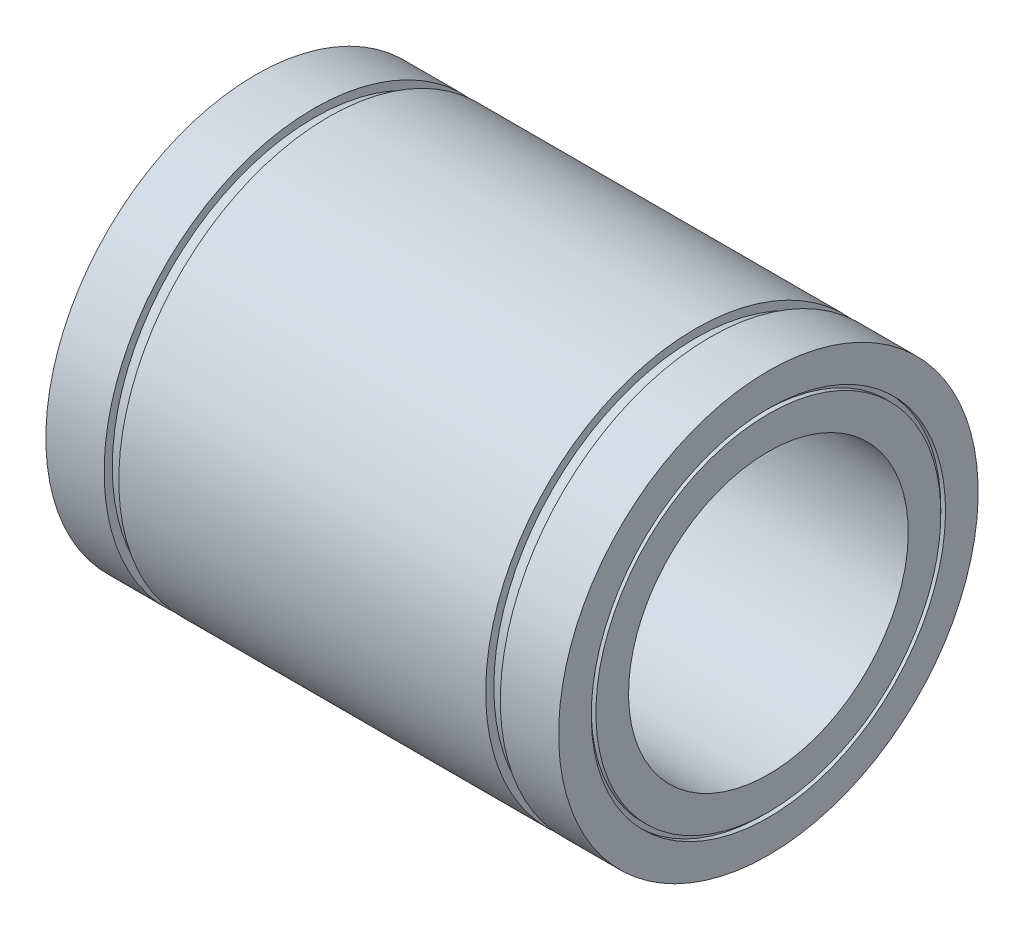
ISO-10303-21;
HEADER;
FILE_DESCRIPTION(('STEP AP214'),'2;1');
FILE_NAME('part.step','',(''),(''),'','','');
FILE_SCHEMA(('AUTOMOTIVE_DESIGN { 1 0 10303 214 1 1 1 1 }'));
ENDSEC;
DATA;
#1=APPLICATION_CONTEXT('core data for automotive mechanical design processes');
#2=APPLICATION_PROTOCOL_DEFINITION('international standard','automotive_design',2000,#1);
#3=PRODUCT_CONTEXT('',#1,'mechanical');
#4=PRODUCT('Part','Part','',(#3));
#5=PRODUCT_RELATED_PRODUCT_CATEGORY('part','',(#4));
#6=PRODUCT_DEFINITION_FORMATION('','',#4);
#7=PRODUCT_DEFINITION_CONTEXT('part definition',#1,'design');
#8=PRODUCT_DEFINITION('design','',#6,#7);
#9=PRODUCT_DEFINITION_SHAPE('','',#8);
#10=(LENGTH_UNIT() NAMED_UNIT(*) SI_UNIT(.MILLI.,.METRE.));
#11=(NAMED_UNIT(*) PLANE_ANGLE_UNIT() SI_UNIT($,.RADIAN.));
#12=(NAMED_UNIT(*) SI_UNIT($,.STERADIAN.) SOLID_ANGLE_UNIT());
#13=UNCERTAINTY_MEASURE_WITH_UNIT(LENGTH_MEASURE(1.E-05),#10,'distance_accuracy_value','');
#14=(GEOMETRIC_REPRESENTATION_CONTEXT(3) GLOBAL_UNCERTAINTY_ASSIGNED_CONTEXT((#13)) GLOBAL_UNIT_ASSIGNED_CONTEXT((#10,
#11,#12)) REPRESENTATION_CONTEXT('',''));
#15=CARTESIAN_POINT('',(0.,0.,0.));
#16=DIRECTION('',(0.,0.,1.));
#17=DIRECTION('',(1.,0.,0.));
#18=AXIS2_PLACEMENT_3D('',#15,#16,#17);
#19=CARTESIAN_POINT('',(-55.,38.,0.));
#20=DIRECTION('',(-1.,0.,0.));
#21=DIRECTION('',(0.,-1.,0.));
#22=AXIS2_PLACEMENT_3D('',#19,#20,#21);
#23=PLANE('',#22);
#24=CARTESIAN_POINT('',(-55.,0.,0.));
#25=DIRECTION('',(1.,0.,0.));
#26=DIRECTION('',(0.,1.,0.));
#27=AXIS2_PLACEMENT_3D('',#24,#25,#26);
#28=CIRCLE('',#27,38.);
#29=CARTESIAN_POINT('',(-55.,38.,0.));
#30=VERTEX_POINT('',#29);
#31=EDGE_CURVE('E121',#30,#30,#28,.T.);
#32=ORIENTED_EDGE('',*,*,#31,.T.);
#33=EDGE_LOOP('',(#32));
#34=FACE_BOUND('',#33,.T.);
#35=CARTESIAN_POINT('',(-55.,0.,0.));
#36=DIRECTION('',(1.,0.,0.));
#37=DIRECTION('',(0.,1.,0.));
#38=AXIS2_PLACEMENT_3D('',#35,#36,#37);
#39=CIRCLE('',#38,45.);
#40=CARTESIAN_POINT('',(-55.,45.,0.));
#41=VERTEX_POINT('',#40);
#42=EDGE_CURVE('E10',#41,#41,#39,.T.);
#43=ORIENTED_EDGE('',*,*,#42,.F.);
#44=EDGE_LOOP('',(#43));
#45=FACE_BOUND('',#44,.T.);
#46=ADVANCED_FACE('F38',(#34,#45),#23,.T.);
#47=CARTESIAN_POINT('',(0.,0.,0.));
#48=DIRECTION('',(1.,0.,0.));
#49=DIRECTION('',(0.,1.,0.));
#50=AXIS2_PLACEMENT_3D('',#47,#48,#49);
#51=CYLINDRICAL_SURFACE('',#50,45.);
#52=ORIENTED_EDGE('',*,*,#42,.T.);
#53=EDGE_LOOP('',(#52));
#54=FACE_BOUND('',#53,.T.);
#55=CARTESIAN_POINT('',(-42.5,0.,0.));
#56=DIRECTION('',(1.,0.,0.));
#57=DIRECTION('',(0.,1.,0.));
#58=AXIS2_PLACEMENT_3D('',#55,#56,#57);
#59=CIRCLE('',#58,45.);
#60=CARTESIAN_POINT('',(-42.5,45.,0.));
#61=VERTEX_POINT('',#60);
#62=EDGE_CURVE('E45',#61,#61,#59,.T.);
#63=ORIENTED_EDGE('',*,*,#62,.F.);
#64=EDGE_LOOP('',(#63));
#65=FACE_BOUND('',#64,.T.);
#66=ADVANCED_FACE('F140',(#54,#65),#51,.T.);
#67=CARTESIAN_POINT('',(-42.5,45.,0.));
#68=DIRECTION('',(1.,0.,0.));
#69=DIRECTION('',(0.,1.,0.));
#70=AXIS2_PLACEMENT_3D('',#67,#68,#69);
#71=PLANE('',#70);
#72=ORIENTED_EDGE('',*,*,#62,.T.);
#73=EDGE_LOOP('',(#72));
#74=FACE_BOUND('',#73,.T.);
#75=CARTESIAN_POINT('',(-42.5,0.,0.));
#76=DIRECTION('',(1.,0.,0.));
#77=DIRECTION('',(0.,1.,0.));
#78=AXIS2_PLACEMENT_3D('',#75,#76,#77);
#79=CIRCLE('',#78,43.25);
#80=CARTESIAN_POINT('',(-42.5,43.25,0.));
#81=VERTEX_POINT('',#80);
#82=EDGE_CURVE('E52',#81,#81,#79,.T.);
#83=ORIENTED_EDGE('',*,*,#82,.F.);
#84=EDGE_LOOP('',(#83));
#85=FACE_BOUND('',#84,.T.);
#86=ADVANCED_FACE('F144',(#74,#85),#71,.T.);
#87=CARTESIAN_POINT('',(0.,0.,0.));
#88=DIRECTION('',(1.,0.,0.));
#89=DIRECTION('',(0.,1.,0.));
#90=AXIS2_PLACEMENT_3D('',#87,#88,#89);
#91=CYLINDRICAL_SURFACE('',#90,43.25);
#92=ORIENTED_EDGE('',*,*,#82,.T.);
#93=EDGE_LOOP('',(#92));
#94=FACE_BOUND('',#93,.T.);
#95=CARTESIAN_POINT('',(-39.35,0.,0.));
#96=DIRECTION('',(1.,0.,0.));
#97=DIRECTION('',(0.,1.,0.));
#98=AXIS2_PLACEMENT_3D('',#95,#96,#97);
#99=CIRCLE('',#98,43.25);
#100=CARTESIAN_POINT('',(-39.35,43.25,0.));
#101=VERTEX_POINT('',#100);
#102=EDGE_CURVE('E59',#101,#101,#99,.T.);
#103=ORIENTED_EDGE('',*,*,#102,.F.);
#104=EDGE_LOOP('',(#103));
#105=FACE_BOUND('',#104,.T.);
#106=ADVANCED_FACE('F148',(#94,#105),#91,.T.);
#107=CARTESIAN_POINT('',(-39.35,43.25,0.));
#108=DIRECTION('',(-1.,0.,0.));
#109=DIRECTION('',(0.,-1.,0.));
#110=AXIS2_PLACEMENT_3D('',#107,#108,#109);
#111=PLANE('',#110);
#112=ORIENTED_EDGE('',*,*,#102,.T.);
#113=EDGE_LOOP('',(#112));
#114=FACE_BOUND('',#113,.T.);
#115=CARTESIAN_POINT('',(-39.35,0.,0.));
#116=DIRECTION('',(1.,0.,0.));
#117=DIRECTION('',(0.,1.,0.));
#118=AXIS2_PLACEMENT_3D('',#115,#116,#117);
#119=CIRCLE('',#118,45.);
#120=CARTESIAN_POINT('',(-39.35,45.,0.));
#121=VERTEX_POINT('',#120);
#122=EDGE_CURVE('E65',#121,#121,#119,.T.);
#123=ORIENTED_EDGE('',*,*,#122,.F.);
#124=EDGE_LOOP('',(#123));
#125=FACE_BOUND('',#124,.T.);
#126=ADVANCED_FACE('F154',(#114,#125),#111,.T.);
#127=CARTESIAN_POINT('',(0.,0.,0.));
#128=DIRECTION('',(1.,0.,0.));
#129=DIRECTION('',(0.,1.,0.));
#130=AXIS2_PLACEMENT_3D('',#127,#128,#129);
#131=CYLINDRICAL_SURFACE('',#130,45.);
#132=ORIENTED_EDGE('',*,*,#122,.T.);
#133=EDGE_LOOP('',(#132));
#134=FACE_BOUND('',#133,.T.);
#135=CARTESIAN_POINT('',(39.35,0.,0.));
#136=DIRECTION('',(1.,0.,0.));
#137=DIRECTION('',(0.,1.,0.));
#138=AXIS2_PLACEMENT_3D('',#135,#136,#137);
#139=CIRCLE('',#138,45.);
#140=CARTESIAN_POINT('',(39.35,45.,0.));
#141=VERTEX_POINT('',#140);
#142=EDGE_CURVE('E69',#141,#141,#139,.T.);
#143=ORIENTED_EDGE('',*,*,#142,.F.);
#144=EDGE_LOOP('',(#143));
#145=FACE_BOUND('',#144,.T.);
#146=ADVANCED_FACE('F158',(#134,#145),#131,.T.);
#147=CARTESIAN_POINT('',(39.35,45.,0.));
#148=DIRECTION('',(1.,0.,0.));
#149=DIRECTION('',(0.,1.,0.));
#150=AXIS2_PLACEMENT_3D('',#147,#148,#149);
#151=PLANE('',#150);
#152=ORIENTED_EDGE('',*,*,#142,.T.);
#153=EDGE_LOOP('',(#152));
#154=FACE_BOUND('',#153,.T.);
#155=CARTESIAN_POINT('',(39.35,0.,0.));
#156=DIRECTION('',(1.,0.,0.));
#157=DIRECTION('',(0.,1.,0.));
#158=AXIS2_PLACEMENT_3D('',#155,#156,#157);
#159=CIRCLE('',#158,43.25);
#160=CARTESIAN_POINT('',(39.35,43.25,0.));
#161=VERTEX_POINT('',#160);
#162=EDGE_CURVE('E72',#161,#161,#159,.T.);
#163=ORIENTED_EDGE('',*,*,#162,.F.);
#164=EDGE_LOOP('',(#163));
#165=FACE_BOUND('',#164,.T.);
#166=ADVANCED_FACE('F162',(#154,#165),#151,.T.);
#167=CARTESIAN_POINT('',(0.,0.,0.));
#168=DIRECTION('',(1.,0.,0.));
#169=DIRECTION('',(0.,1.,0.));
#170=AXIS2_PLACEMENT_3D('',#167,#168,#169);
#171=CYLINDRICAL_SURFACE('',#170,43.25);
#172=ORIENTED_EDGE('',*,*,#162,.T.);
#173=EDGE_LOOP('',(#172));
#174=FACE_BOUND('',#173,.T.);
#175=CARTESIAN_POINT('',(42.5,0.,0.));
#176=DIRECTION('',(1.,0.,0.));
#177=DIRECTION('',(0.,1.,0.));
#178=AXIS2_PLACEMENT_3D('',#175,#176,#177);
#179=CIRCLE('',#178,43.25);
#180=CARTESIAN_POINT('',(42.5,43.25,0.));
#181=VERTEX_POINT('',#180);
#182=EDGE_CURVE('E76',#181,#181,#179,.T.);
#183=ORIENTED_EDGE('',*,*,#182,.F.);
#184=EDGE_LOOP('',(#183));
#185=FACE_BOUND('',#184,.T.);
#186=ADVANCED_FACE('F166',(#174,#185),#171,.T.);
#187=CARTESIAN_POINT('',(42.5,43.25,0.));
#188=DIRECTION('',(-1.,0.,0.));
#189=DIRECTION('',(0.,-1.,0.));
#190=AXIS2_PLACEMENT_3D('',#187,#188,#189);
#191=PLANE('',#190);
#192=ORIENTED_EDGE('',*,*,#182,.T.);
#193=EDGE_LOOP('',(#192));
#194=FACE_BOUND('',#193,.T.);
#195=CARTESIAN_POINT('',(42.5,0.,0.));
#196=DIRECTION('',(1.,0.,0.));
#197=DIRECTION('',(0.,1.,0.));
#198=AXIS2_PLACEMENT_3D('',#195,#196,#197);
#199=CIRCLE('',#198,45.);
#200=CARTESIAN_POINT('',(42.5,45.,0.));
#201=VERTEX_POINT('',#200);
#202=EDGE_CURVE('E80',#201,#201,#199,.T.);
#203=ORIENTED_EDGE('',*,*,#202,.F.);
#204=EDGE_LOOP('',(#203));
#205=FACE_BOUND('',#204,.T.);
#206=ADVANCED_FACE('F170',(#194,#205),#191,.T.);
#207=CARTESIAN_POINT('',(0.,0.,0.));
#208=DIRECTION('',(1.,0.,0.));
#209=DIRECTION('',(0.,1.,0.));
#210=AXIS2_PLACEMENT_3D('',#207,#208,#209);
#211=CYLINDRICAL_SURFACE('',#210,44.9999999999999);
#212=ORIENTED_EDGE('',*,*,#202,.T.);
#213=EDGE_LOOP('',(#212));
#214=FACE_BOUND('',#213,.T.);
#215=CARTESIAN_POINT('',(55.,0.,0.));
#216=DIRECTION('',(1.,0.,0.));
#217=DIRECTION('',(0.,1.,0.));
#218=AXIS2_PLACEMENT_3D('',#215,#216,#217);
#219=CIRCLE('',#218,44.9999999999998);
#220=CARTESIAN_POINT('',(55.,44.9999999999999,0.));
#221=VERTEX_POINT('',#220);
#222=EDGE_CURVE('E83',#221,#221,#219,.T.);
#223=ORIENTED_EDGE('',*,*,#222,.F.);
#224=EDGE_LOOP('',(#223));
#225=FACE_BOUND('',#224,.T.);
#226=ADVANCED_FACE('F174',(#214,#225),#211,.T.);
#227=CARTESIAN_POINT('',(55.,44.9999999999999,0.));
#228=DIRECTION('',(1.,0.,0.));
#229=DIRECTION('',(0.,1.,0.));
#230=AXIS2_PLACEMENT_3D('',#227,#228,#229);
#231=PLANE('',#230);
#232=ORIENTED_EDGE('',*,*,#222,.T.);
#233=EDGE_LOOP('',(#232));
#234=FACE_BOUND('',#233,.T.);
#235=CARTESIAN_POINT('',(55.,0.,0.));
#236=DIRECTION('',(1.,0.,0.));
#237=DIRECTION('',(0.,1.,0.));
#238=AXIS2_PLACEMENT_3D('',#235,#236,#237);
#239=CIRCLE('',#238,37.9999999999999);
#240=CARTESIAN_POINT('',(55.,37.9999999999999,0.));
#241=VERTEX_POINT('',#240);
#242=EDGE_CURVE('E87',#241,#241,#239,.T.);
#243=ORIENTED_EDGE('',*,*,#242,.F.);
#244=EDGE_LOOP('',(#243));
#245=FACE_BOUND('',#244,.T.);
#246=ADVANCED_FACE('F178',(#234,#245),#231,.T.);
#247=CARTESIAN_POINT('',(0.,0.,0.));
#248=DIRECTION('',(1.,0.,0.));
#249=DIRECTION('',(0.,1.,0.));
#250=AXIS2_PLACEMENT_3D('',#247,#248,#249);
#251=CYLINDRICAL_SURFACE('',#250,37.9999999999999);
#252=ORIENTED_EDGE('',*,*,#242,.T.);
#253=EDGE_LOOP('',(#252));
#254=FACE_BOUND('',#253,.T.);
#255=CARTESIAN_POINT('',(54.,0.,0.));
#256=DIRECTION('',(1.,0.,0.));
#257=DIRECTION('',(0.,1.,0.));
#258=AXIS2_PLACEMENT_3D('',#255,#256,#257);
#259=CIRCLE('',#258,37.9999999999999);
#260=CARTESIAN_POINT('',(54.,37.9999999999999,0.));
#261=VERTEX_POINT('',#260);
#262=EDGE_CURVE('E91',#261,#261,#259,.T.);
#263=ORIENTED_EDGE('',*,*,#262,.F.);
#264=EDGE_LOOP('',(#263));
#265=FACE_BOUND('',#264,.T.);
#266=ADVANCED_FACE('F182',(#254,#265),#251,.F.);
#267=CARTESIAN_POINT('',(54.,37.9999999999999,0.));
#268=DIRECTION('',(1.,0.,0.));
#269=DIRECTION('',(0.,1.,0.));
#270=AXIS2_PLACEMENT_3D('',#267,#268,#269);
#271=PLANE('',#270);
#272=ORIENTED_EDGE('',*,*,#262,.T.);
#273=EDGE_LOOP('',(#272));
#274=FACE_BOUND('',#273,.T.);
#275=CARTESIAN_POINT('',(54.,0.,0.));
#276=DIRECTION('',(1.,0.,0.));
#277=DIRECTION('',(0.,1.,0.));
#278=AXIS2_PLACEMENT_3D('',#275,#276,#277);
#279=CIRCLE('',#278,36.9999999999999);
#280=CARTESIAN_POINT('',(54.,36.9999999999999,0.));
#281=VERTEX_POINT('',#280);
#282=EDGE_CURVE('E94',#281,#281,#279,.T.);
#283=ORIENTED_EDGE('',*,*,#282,.F.);
#284=EDGE_LOOP('',(#283));
#285=FACE_BOUND('',#284,.T.);
#286=ADVANCED_FACE('F186',(#274,#285),#271,.T.);
#287=CARTESIAN_POINT('',(0.,0.,0.));
#288=DIRECTION('',(1.,0.,0.));
#289=DIRECTION('',(0.,1.,0.));
#290=AXIS2_PLACEMENT_3D('',#287,#288,#289);
#291=CYLINDRICAL_SURFACE('',#290,36.9999999999999);
#292=ORIENTED_EDGE('',*,*,#282,.T.);
#293=EDGE_LOOP('',(#292));
#294=FACE_BOUND('',#293,.T.);
#295=CARTESIAN_POINT('',(55.,0.,0.));
#296=DIRECTION('',(1.,0.,0.));
#297=DIRECTION('',(0.,1.,0.));
#298=AXIS2_PLACEMENT_3D('',#295,#296,#297);
#299=CIRCLE('',#298,36.9999999999999);
#300=CARTESIAN_POINT('',(55.,36.9999999999999,0.));
#301=VERTEX_POINT('',#300);
#302=EDGE_CURVE('E98',#301,#301,#299,.T.);
#303=ORIENTED_EDGE('',*,*,#302,.F.);
#304=EDGE_LOOP('',(#303));
#305=FACE_BOUND('',#304,.T.);
#306=ADVANCED_FACE('F190',(#294,#305),#291,.T.);
#307=CARTESIAN_POINT('',(55.,36.9999999999999,0.));
#308=DIRECTION('',(1.,0.,0.));
#309=DIRECTION('',(0.,1.,0.));
#310=AXIS2_PLACEMENT_3D('',#307,#308,#309);
#311=PLANE('',#310);
#312=ORIENTED_EDGE('',*,*,#302,.T.);
#313=EDGE_LOOP('',(#312));
#314=FACE_BOUND('',#313,.T.);
#315=CARTESIAN_POINT('',(55.,0.,0.));
#316=DIRECTION('',(1.,0.,0.));
#317=DIRECTION('',(0.,1.,0.));
#318=AXIS2_PLACEMENT_3D('',#315,#316,#317);
#319=CIRCLE('',#318,30.);
#320=CARTESIAN_POINT('',(55.,30.,0.));
#321=VERTEX_POINT('',#320);
#322=EDGE_CURVE('E102',#321,#321,#319,.T.);
#323=ORIENTED_EDGE('',*,*,#322,.F.);
#324=EDGE_LOOP('',(#323));
#325=FACE_BOUND('',#324,.T.);
#326=ADVANCED_FACE('F194',(#314,#325),#311,.T.);
#327=CARTESIAN_POINT('',(0.,0.,0.));
#328=DIRECTION('',(1.,0.,0.));
#329=DIRECTION('',(0.,1.,0.));
#330=AXIS2_PLACEMENT_3D('',#327,#328,#329);
#331=CYLINDRICAL_SURFACE('',#330,30.);
#332=ORIENTED_EDGE('',*,*,#322,.T.);
#333=EDGE_LOOP('',(#332));
#334=FACE_BOUND('',#333,.T.);
#335=CARTESIAN_POINT('',(-55.,0.,0.));
#336=DIRECTION('',(1.,0.,0.));
#337=DIRECTION('',(0.,1.,0.));
#338=AXIS2_PLACEMENT_3D('',#335,#336,#337);
#339=CIRCLE('',#338,30.);
#340=CARTESIAN_POINT('',(-55.,30.,0.));
#341=VERTEX_POINT('',#340);
#342=EDGE_CURVE('E106',#341,#341,#339,.T.);
#343=ORIENTED_EDGE('',*,*,#342,.F.);
#344=EDGE_LOOP('',(#343));
#345=FACE_BOUND('',#344,.T.);
#346=ADVANCED_FACE('F198',(#334,#345),#331,.F.);
#347=CARTESIAN_POINT('',(-55.,30.,0.));
#348=DIRECTION('',(-1.,0.,0.));
#349=DIRECTION('',(0.,-1.,0.));
#350=AXIS2_PLACEMENT_3D('',#347,#348,#349);
#351=PLANE('',#350);
#352=ORIENTED_EDGE('',*,*,#342,.T.);
#353=EDGE_LOOP('',(#352));
#354=FACE_BOUND('',#353,.T.);
#355=CARTESIAN_POINT('',(-55.,0.,0.));
#356=DIRECTION('',(1.,0.,0.));
#357=DIRECTION('',(0.,1.,0.));
#358=AXIS2_PLACEMENT_3D('',#355,#356,#357);
#359=CIRCLE('',#358,37.);
#360=CARTESIAN_POINT('',(-55.,37.,0.));
#361=VERTEX_POINT('',#360);
#362=EDGE_CURVE('E110',#361,#361,#359,.T.);
#363=ORIENTED_EDGE('',*,*,#362,.F.);
#364=EDGE_LOOP('',(#363));
#365=FACE_BOUND('',#364,.T.);
#366=ADVANCED_FACE('F202',(#354,#365),#351,.T.);
#367=CARTESIAN_POINT('',(0.,0.,0.));
#368=DIRECTION('',(1.,0.,0.));
#369=DIRECTION('',(0.,1.,0.));
#370=AXIS2_PLACEMENT_3D('',#367,#368,#369);
#371=CYLINDRICAL_SURFACE('',#370,37.);
#372=ORIENTED_EDGE('',*,*,#362,.T.);
#373=EDGE_LOOP('',(#372));
#374=FACE_BOUND('',#373,.T.);
#375=CARTESIAN_POINT('',(-54.,0.,0.));
#376=DIRECTION('',(1.,0.,0.));
#377=DIRECTION('',(0.,1.,0.));
#378=AXIS2_PLACEMENT_3D('',#375,#376,#377);
#379=CIRCLE('',#378,37.);
#380=CARTESIAN_POINT('',(-54.,37.,0.));
#381=VERTEX_POINT('',#380);
#382=EDGE_CURVE('E114',#381,#381,#379,.T.);
#383=ORIENTED_EDGE('',*,*,#382,.F.);
#384=EDGE_LOOP('',(#383));
#385=FACE_BOUND('',#384,.T.);
#386=ADVANCED_FACE('F136',(#374,#385),#371,.T.);
#387=CARTESIAN_POINT('',(-54.,38.,0.));
#388=DIRECTION('',(-1.,0.,0.));
#389=DIRECTION('',(0.,-1.,0.));
#390=AXIS2_PLACEMENT_3D('',#387,#388,#389);
#391=PLANE('',#390);
#392=ORIENTED_EDGE('',*,*,#382,.T.);
#393=EDGE_LOOP('',(#392));
#394=FACE_BOUND('',#393,.T.);
#395=CARTESIAN_POINT('',(-54.,0.,0.));
#396=DIRECTION('',(1.,0.,0.));
#397=DIRECTION('',(0.,1.,0.));
#398=AXIS2_PLACEMENT_3D('',#395,#396,#397);
#399=CIRCLE('',#398,38.);
#400=CARTESIAN_POINT('',(-54.,38.,0.));
#401=VERTEX_POINT('',#400);
#402=EDGE_CURVE('E117',#401,#401,#399,.T.);
#403=ORIENTED_EDGE('',*,*,#402,.F.);
#404=EDGE_LOOP('',(#403));
#405=FACE_BOUND('',#404,.T.);
#406=ADVANCED_FACE('F130',(#394,#405),#391,.T.);
#407=CARTESIAN_POINT('',(0.,0.,0.));
#408=DIRECTION('',(1.,0.,0.));
#409=DIRECTION('',(0.,1.,0.));
#410=AXIS2_PLACEMENT_3D('',#407,#408,#409);
#411=CYLINDRICAL_SURFACE('',#410,38.);
#412=ORIENTED_EDGE('',*,*,#402,.T.);
#413=EDGE_LOOP('',(#412));
#414=FACE_BOUND('',#413,.T.);
#415=ORIENTED_EDGE('',*,*,#31,.F.);
#416=EDGE_LOOP('',(#415));
#417=FACE_BOUND('',#416,.T.);
#418=ADVANCED_FACE('F128',(#414,#417),#411,.F.);
#419=CLOSED_SHELL('',(#46,#66,#86,#106,#126,#146,#166,#186,#206,#226,#246,#266,#286,#306,#326,
#346,#366,#386,#406,#418));
#420=MANIFOLD_SOLID_BREP('B2',#419);
#421=ADVANCED_BREP_SHAPE_REPRESENTATION('',(#18,#420),#14);
#422=SHAPE_DEFINITION_REPRESENTATION(#9,#421);
ENDSEC;
END-ISO-10303-21;
